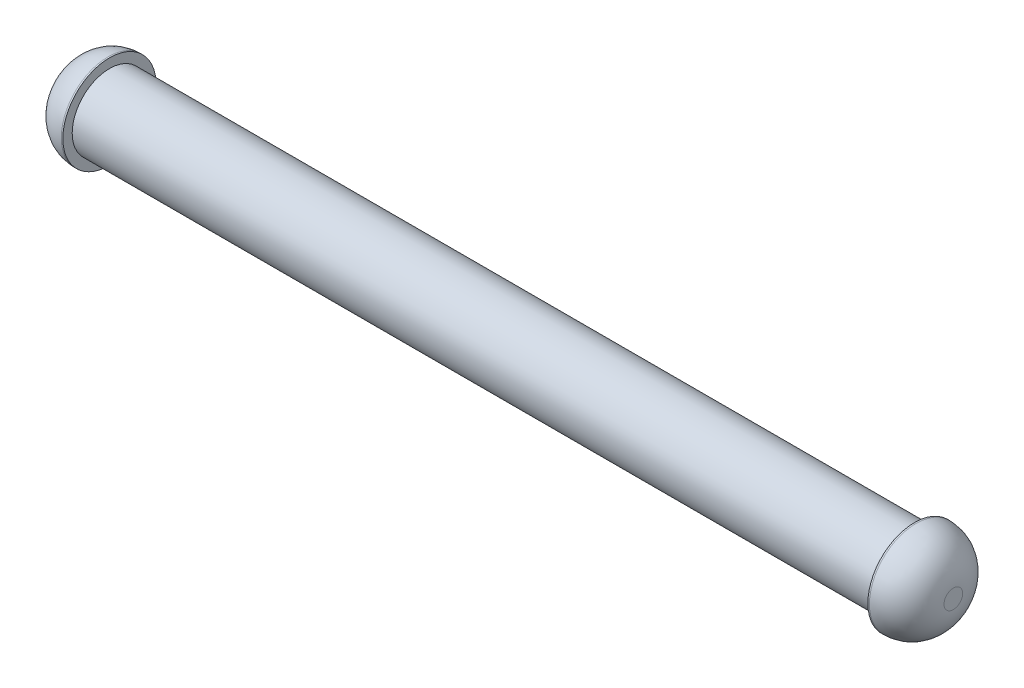
ISO-10303-21;
HEADER;
FILE_DESCRIPTION(('STEP AP214'),'2;1');
FILE_NAME('part.step','',(''),(''),'','','');
FILE_SCHEMA(('AUTOMOTIVE_DESIGN { 1 0 10303 214 1 1 1 1 }'));
ENDSEC;
DATA;
#1=APPLICATION_CONTEXT('core data for automotive mechanical design processes');
#2=APPLICATION_PROTOCOL_DEFINITION('international standard','automotive_design',2000,#1);
#3=PRODUCT_CONTEXT('',#1,'mechanical');
#4=PRODUCT('Part','Part','',(#3));
#5=PRODUCT_RELATED_PRODUCT_CATEGORY('part','',(#4));
#6=PRODUCT_DEFINITION_FORMATION('','',#4);
#7=PRODUCT_DEFINITION_CONTEXT('part definition',#1,'design');
#8=PRODUCT_DEFINITION('design','',#6,#7);
#9=PRODUCT_DEFINITION_SHAPE('','',#8);
#10=(LENGTH_UNIT() NAMED_UNIT(*) SI_UNIT(.MILLI.,.METRE.));
#11=(NAMED_UNIT(*) PLANE_ANGLE_UNIT() SI_UNIT($,.RADIAN.));
#12=(NAMED_UNIT(*) SI_UNIT($,.STERADIAN.) SOLID_ANGLE_UNIT());
#13=UNCERTAINTY_MEASURE_WITH_UNIT(LENGTH_MEASURE(1.E-05),#10,'distance_accuracy_value','');
#14=(GEOMETRIC_REPRESENTATION_CONTEXT(3) GLOBAL_UNCERTAINTY_ASSIGNED_CONTEXT((#13)) GLOBAL_UNIT_ASSIGNED_CONTEXT((#10,
#11,#12)) REPRESENTATION_CONTEXT('',''));
#15=CARTESIAN_POINT('',(0.,0.,0.));
#16=DIRECTION('',(0.,0.,1.));
#17=DIRECTION('',(1.,0.,0.));
#18=AXIS2_PLACEMENT_3D('',#15,#16,#17);
#19=CARTESIAN_POINT('',(71.,0.,0.));
#20=DIRECTION('',(-1.,0.,0.));
#21=DIRECTION('',(0.,0.,1.));
#22=AXIS2_PLACEMENT_3D('',#19,#20,#21);
#23=PLANE('',#22);
#24=CARTESIAN_POINT('',(71.,0.,0.));
#25=DIRECTION('',(-1.,0.,0.));
#26=DIRECTION('',(0.,0.,1.));
#27=AXIS2_PLACEMENT_3D('',#24,#25,#26);
#28=CIRCLE('',#27,1.5);
#29=CARTESIAN_POINT('',(71.,0.,1.5));
#30=VERTEX_POINT('',#29);
#31=EDGE_CURVE('E10',#30,#30,#28,.F.);
#32=ORIENTED_EDGE('',*,*,#31,.T.);
#33=EDGE_LOOP('',(#32));
#34=FACE_BOUND('',#33,.T.);
#35=ADVANCED_FACE('F32',(#34),#23,.F.);
#36=CARTESIAN_POINT('',(-71.,0.,0.));
#37=DIRECTION('',(-1.,0.,0.));
#38=DIRECTION('',(0.,0.,1.));
#39=AXIS2_PLACEMENT_3D('',#36,#37,#38);
#40=CYLINDRICAL_SURFACE('',#39,7.5);
#41=CARTESIAN_POINT('',(65.,0.,0.));
#42=DIRECTION('',(-1.,0.,0.));
#43=DIRECTION('',(0.,0.,1.));
#44=AXIS2_PLACEMENT_3D('',#41,#42,#43);
#45=CIRCLE('',#44,7.5);
#46=CARTESIAN_POINT('',(65.,0.,7.50000000000001));
#47=VERTEX_POINT('',#46);
#48=EDGE_CURVE('E39',#47,#47,#45,.T.);
#49=ORIENTED_EDGE('',*,*,#48,.T.);
#50=EDGE_LOOP('',(#49));
#51=FACE_BOUND('',#50,.T.);
#52=CARTESIAN_POINT('',(64.75,0.,0.));
#53=DIRECTION('',(-1.,0.,0.));
#54=DIRECTION('',(0.,0.,1.));
#55=AXIS2_PLACEMENT_3D('',#52,#53,#54);
#56=CIRCLE('',#55,7.5);
#57=CARTESIAN_POINT('',(64.75,0.,7.50000000000001));
#58=VERTEX_POINT('',#57);
#59=EDGE_CURVE('E52',#58,#58,#56,.T.);
#60=ORIENTED_EDGE('',*,*,#59,.F.);
#61=EDGE_LOOP('',(#60));
#62=FACE_BOUND('',#61,.T.);
#63=ADVANCED_FACE('F82',(#51,#62),#40,.T.);
#64=CARTESIAN_POINT('',(64.75,0.,-7.49999999999999));
#65=DIRECTION('',(1.,0.,0.));
#66=DIRECTION('',(0.,0.,-1.));
#67=AXIS2_PLACEMENT_3D('',#64,#65,#66);
#68=PLANE('',#67);
#69=CARTESIAN_POINT('',(64.75,0.,0.));
#70=DIRECTION('',(-1.,0.,0.));
#71=DIRECTION('',(0.,0.,1.));
#72=AXIS2_PLACEMENT_3D('',#69,#70,#71);
#73=CIRCLE('',#72,6.);
#74=CARTESIAN_POINT('',(64.75,0.,6.00000000000001));
#75=VERTEX_POINT('',#74);
#76=EDGE_CURVE('E55',#75,#75,#73,.T.);
#77=ORIENTED_EDGE('',*,*,#76,.F.);
#78=EDGE_LOOP('',(#77));
#79=FACE_BOUND('',#78,.T.);
#80=ORIENTED_EDGE('',*,*,#59,.T.);
#81=EDGE_LOOP('',(#80));
#82=FACE_BOUND('',#81,.T.);
#83=ADVANCED_FACE('F76',(#79,#82),#68,.F.);
#84=CARTESIAN_POINT('',(-71.,0.,0.));
#85=DIRECTION('',(-1.,0.,0.));
#86=DIRECTION('',(0.,0.,1.));
#87=AXIS2_PLACEMENT_3D('',#84,#85,#86);
#88=CYLINDRICAL_SURFACE('',#87,6.);
#89=CARTESIAN_POINT('',(-64.75,0.,0.));
#90=DIRECTION('',(-1.,0.,0.));
#91=DIRECTION('',(0.,0.,1.));
#92=AXIS2_PLACEMENT_3D('',#89,#90,#91);
#93=CIRCLE('',#92,6.);
#94=CARTESIAN_POINT('',(-64.75,0.,6.00000000000001));
#95=VERTEX_POINT('',#94);
#96=EDGE_CURVE('E58',#95,#95,#93,.T.);
#97=ORIENTED_EDGE('',*,*,#96,.F.);
#98=EDGE_LOOP('',(#97));
#99=FACE_BOUND('',#98,.T.);
#100=ORIENTED_EDGE('',*,*,#76,.T.);
#101=EDGE_LOOP('',(#100));
#102=FACE_BOUND('',#101,.T.);
#103=ADVANCED_FACE('F70',(#99,#102),#88,.T.);
#104=CARTESIAN_POINT('',(-64.75,0.,-7.49999999999999));
#105=DIRECTION('',(-1.,0.,0.));
#106=DIRECTION('',(0.,0.,1.));
#107=AXIS2_PLACEMENT_3D('',#104,#105,#106);
#108=PLANE('',#107);
#109=CARTESIAN_POINT('',(-64.75,0.,0.));
#110=DIRECTION('',(-1.,0.,0.));
#111=DIRECTION('',(0.,0.,1.));
#112=AXIS2_PLACEMENT_3D('',#109,#110,#111);
#113=CIRCLE('',#112,7.5);
#114=CARTESIAN_POINT('',(-64.75,0.,7.50000000000001));
#115=VERTEX_POINT('',#114);
#116=EDGE_CURVE('E61',#115,#115,#113,.T.);
#117=ORIENTED_EDGE('',*,*,#116,.F.);
#118=EDGE_LOOP('',(#117));
#119=FACE_BOUND('',#118,.T.);
#120=ORIENTED_EDGE('',*,*,#96,.T.);
#121=EDGE_LOOP('',(#120));
#122=FACE_BOUND('',#121,.T.);
#123=ADVANCED_FACE('F67',(#119,#122),#108,.F.);
#124=CARTESIAN_POINT('',(-71.,0.,0.));
#125=DIRECTION('',(-1.,0.,0.));
#126=DIRECTION('',(0.,0.,1.));
#127=AXIS2_PLACEMENT_3D('',#124,#125,#126);
#128=CYLINDRICAL_SURFACE('',#127,7.5);
#129=CARTESIAN_POINT('',(-65.,0.,0.));
#130=DIRECTION('',(1.,0.,0.));
#131=DIRECTION('',(0.,0.,-1.));
#132=AXIS2_PLACEMENT_3D('',#129,#130,#131);
#133=CIRCLE('',#132,7.5);
#134=CARTESIAN_POINT('',(-65.,0.,-7.49999999999999));
#135=VERTEX_POINT('',#134);
#136=EDGE_CURVE('E43',#135,#135,#133,.T.);
#137=ORIENTED_EDGE('',*,*,#136,.T.);
#138=EDGE_LOOP('',(#137));
#139=FACE_BOUND('',#138,.T.);
#140=ORIENTED_EDGE('',*,*,#116,.T.);
#141=EDGE_LOOP('',(#140));
#142=FACE_BOUND('',#141,.T.);
#143=ADVANCED_FACE('F65',(#139,#142),#128,.T.);
#144=CARTESIAN_POINT('',(-71.,0.,0.));
#145=DIRECTION('',(1.,0.,0.));
#146=DIRECTION('',(0.,0.,-1.));
#147=AXIS2_PLACEMENT_3D('',#144,#145,#146);
#148=PLANE('',#147);
#149=CARTESIAN_POINT('',(-71.,0.,0.));
#150=DIRECTION('',(1.,0.,0.));
#151=DIRECTION('',(0.,0.,-1.));
#152=AXIS2_PLACEMENT_3D('',#149,#150,#151);
#153=CIRCLE('',#152,1.5);
#154=CARTESIAN_POINT('',(-71.,0.,-1.49999999999999));
#155=VERTEX_POINT('',#154);
#156=EDGE_CURVE('E47',#155,#155,#153,.F.);
#157=ORIENTED_EDGE('',*,*,#156,.T.);
#158=EDGE_LOOP('',(#157));
#159=FACE_BOUND('',#158,.T.);
#160=ADVANCED_FACE('F94',(#159),#148,.F.);
#161=CARTESIAN_POINT('',(-65.,0.,0.));
#162=DIRECTION('',(1.,0.,0.));
#163=DIRECTION('',(0.,0.,-1.));
#164=AXIS2_PLACEMENT_3D('',#161,#162,#163);
#165=DEGENERATE_TOROIDAL_SURFACE('',#164,1.5,6.,.T.);
#166=ORIENTED_EDGE('',*,*,#136,.F.);
#167=EDGE_LOOP('',(#166));
#168=FACE_BOUND('',#167,.T.);
#169=ORIENTED_EDGE('',*,*,#156,.F.);
#170=EDGE_LOOP('',(#169));
#171=FACE_BOUND('',#170,.T.);
#172=ADVANCED_FACE('F92',(#168,#171),#165,.T.);
#173=CARTESIAN_POINT('',(65.,0.,0.));
#174=DIRECTION('',(-1.,0.,0.));
#175=DIRECTION('',(0.,0.,1.));
#176=AXIS2_PLACEMENT_3D('',#173,#174,#175);
#177=DEGENERATE_TOROIDAL_SURFACE('',#176,1.5,6.,.T.);
#178=ORIENTED_EDGE('',*,*,#31,.F.);
#179=EDGE_LOOP('',(#178));
#180=FACE_BOUND('',#179,.T.);
#181=ORIENTED_EDGE('',*,*,#48,.F.);
#182=EDGE_LOOP('',(#181));
#183=FACE_BOUND('',#182,.T.);
#184=ADVANCED_FACE('F34',(#180,#183),#177,.T.);
#185=CLOSED_SHELL('',(#35,#63,#83,#103,#123,#143,#160,#172,#184));
#186=MANIFOLD_SOLID_BREP('B2',#185);
#187=ADVANCED_BREP_SHAPE_REPRESENTATION('',(#18,#186),#14);
#188=SHAPE_DEFINITION_REPRESENTATION(#9,#187);
ENDSEC;
END-ISO-10303-21;
